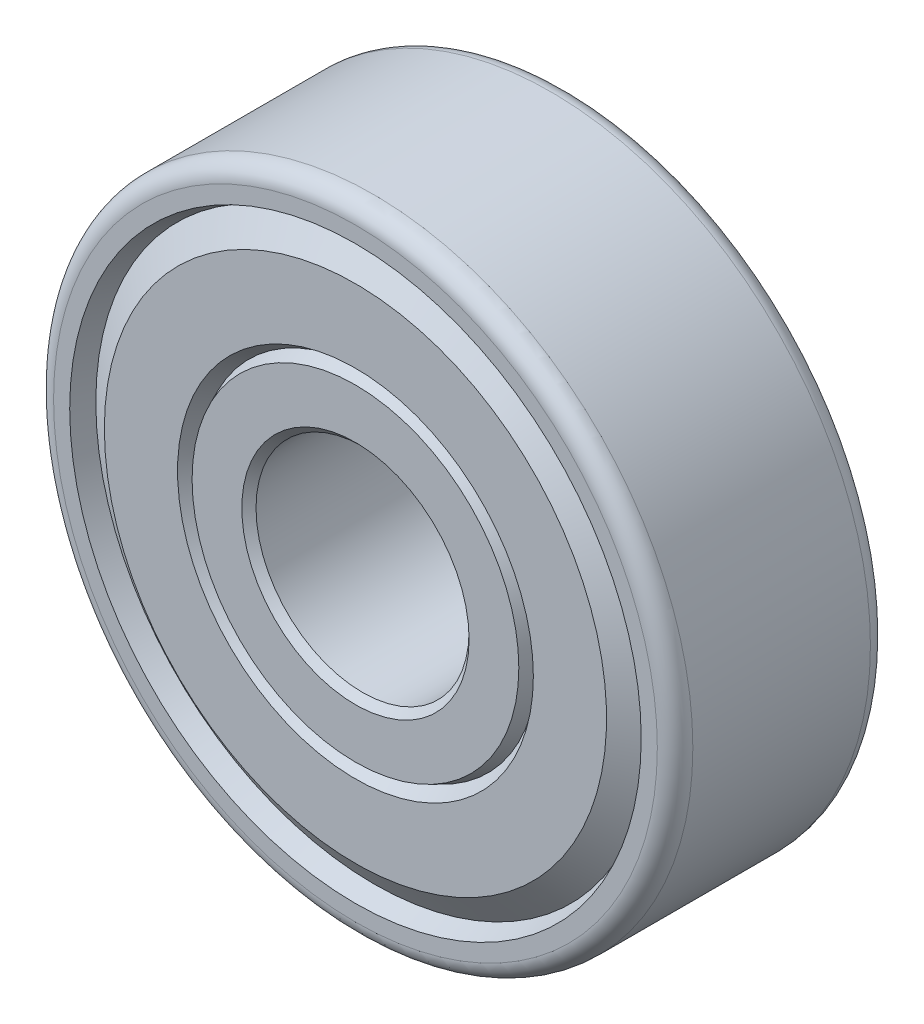
ISO-10303-21;
HEADER;
FILE_DESCRIPTION(('STEP AP214'),'2;1');
FILE_NAME('part.step','',(''),(''),'','','');
FILE_SCHEMA(('AUTOMOTIVE_DESIGN { 1 0 10303 214 1 1 1 1 }'));
ENDSEC;
DATA;
#1=APPLICATION_CONTEXT('core data for automotive mechanical design processes');
#2=APPLICATION_PROTOCOL_DEFINITION('international standard','automotive_design',2000,#1);
#3=PRODUCT_CONTEXT('',#1,'mechanical');
#4=PRODUCT('Part','Part','',(#3));
#5=PRODUCT_RELATED_PRODUCT_CATEGORY('part','',(#4));
#6=PRODUCT_DEFINITION_FORMATION('','',#4);
#7=PRODUCT_DEFINITION_CONTEXT('part definition',#1,'design');
#8=PRODUCT_DEFINITION('design','',#6,#7);
#9=PRODUCT_DEFINITION_SHAPE('','',#8);
#10=(LENGTH_UNIT() NAMED_UNIT(*) SI_UNIT(.MILLI.,.METRE.));
#11=(NAMED_UNIT(*) PLANE_ANGLE_UNIT() SI_UNIT($,.RADIAN.));
#12=(NAMED_UNIT(*) SI_UNIT($,.STERADIAN.) SOLID_ANGLE_UNIT());
#13=UNCERTAINTY_MEASURE_WITH_UNIT(LENGTH_MEASURE(1.E-05),#10,'distance_accuracy_value','');
#14=(GEOMETRIC_REPRESENTATION_CONTEXT(3) GLOBAL_UNCERTAINTY_ASSIGNED_CONTEXT((#13)) GLOBAL_UNIT_ASSIGNED_CONTEXT((#10,
#11,#12)) REPRESENTATION_CONTEXT('',''));
#15=CARTESIAN_POINT('',(0.,0.,0.));
#16=DIRECTION('',(0.,0.,1.));
#17=DIRECTION('',(1.,0.,0.));
#18=AXIS2_PLACEMENT_3D('',#15,#16,#17);
#19=CARTESIAN_POINT('',(0.,0.,0.));
#20=DIRECTION('',(0.,0.,1.));
#21=DIRECTION('',(1.,0.,0.));
#22=AXIS2_PLACEMENT_3D('',#19,#20,#21);
#23=CYLINDRICAL_SURFACE('',#22,4.7625);
#24=CARTESIAN_POINT('',(0.,0.,-4.44499999986192));
#25=DIRECTION('',(0.,0.,-1.));
#26=DIRECTION('',(-1.,0.,0.));
#27=AXIS2_PLACEMENT_3D('',#24,#25,#26);
#28=CIRCLE('',#27,4.76250000008349);
#29=CARTESIAN_POINT('',(-4.76250000008349,0.,-4.44499999986192));
#30=VERTEX_POINT('',#29);
#31=EDGE_CURVE('E320',#30,#30,#28,.T.);
#32=ORIENTED_EDGE('',*,*,#31,.T.);
#33=EDGE_LOOP('',(#32));
#34=FACE_BOUND('',#33,.T.);
#35=CARTESIAN_POINT('',(0.,0.,4.44499999986192));
#36=DIRECTION('',(0.,0.,1.));
#37=DIRECTION('',(-1.,0.,0.));
#38=AXIS2_PLACEMENT_3D('',#35,#36,#37);
#39=CIRCLE('',#38,4.76250000008349);
#40=CARTESIAN_POINT('',(-4.76250000008349,0.,4.44499999986192));
#41=VERTEX_POINT('',#40);
#42=EDGE_CURVE('E323',#41,#41,#39,.T.);
#43=ORIENTED_EDGE('',*,*,#42,.T.);
#44=EDGE_LOOP('',(#43));
#45=FACE_BOUND('',#44,.T.);
#46=ADVANCED_FACE('F17',(#34,#45),#23,.F.);
#47=CARTESIAN_POINT('',(0.,0.,-4.7624999999698));
#48=DIRECTION('',(0.,0.,-1.));
#49=DIRECTION('',(-1.,0.,0.));
#50=AXIS2_PLACEMENT_3D('',#47,#48,#49);
#51=CONICAL_SURFACE('',#50,5.07999999962294,0.785398162502276);
#52=CARTESIAN_POINT('',(0.,0.,-4.76250000008349));
#53=DIRECTION('',(0.,0.,-1.));
#54=DIRECTION('',(-1.,0.,0.));
#55=AXIS2_PLACEMENT_3D('',#52,#53,#54);
#56=CIRCLE('',#55,5.07999999973663);
#57=CARTESIAN_POINT('',(-5.07999999973663,0.,-4.76250000008349));
#58=VERTEX_POINT('',#57);
#59=EDGE_CURVE('E324',#58,#58,#56,.F.);
#60=ORIENTED_EDGE('',*,*,#59,.F.);
#61=EDGE_LOOP('',(#60));
#62=FACE_BOUND('',#61,.T.);
#63=ORIENTED_EDGE('',*,*,#31,.F.);
#64=EDGE_LOOP('',(#63));
#65=FACE_BOUND('',#64,.T.);
#66=ADVANCED_FACE('F249',(#62,#65),#51,.F.);
#67=CARTESIAN_POINT('',(0.,0.,4.7624999999698));
#68=DIRECTION('',(0.,0.,1.));
#69=DIRECTION('',(1.,0.,0.));
#70=AXIS2_PLACEMENT_3D('',#67,#68,#69);
#71=CONICAL_SURFACE('',#70,5.07999999962294,0.785398162502276);
#72=ORIENTED_EDGE('',*,*,#42,.F.);
#73=EDGE_LOOP('',(#72));
#74=FACE_BOUND('',#73,.T.);
#75=CARTESIAN_POINT('',(0.,0.,4.76250000008349));
#76=DIRECTION('',(0.,0.,1.));
#77=DIRECTION('',(1.,0.,0.));
#78=AXIS2_PLACEMENT_3D('',#75,#76,#77);
#79=CIRCLE('',#78,5.07999999973663);
#80=CARTESIAN_POINT('',(5.07999999973663,0.,4.76250000008349));
#81=VERTEX_POINT('',#80);
#82=EDGE_CURVE('E327',#81,#81,#79,.T.);
#83=ORIENTED_EDGE('',*,*,#82,.T.);
#84=EDGE_LOOP('',(#83));
#85=FACE_BOUND('',#84,.T.);
#86=ADVANCED_FACE('F241',(#74,#85),#71,.F.);
#87=CARTESIAN_POINT('',(0.,0.,-4.7625));
#88=DIRECTION('',(0.,0.,-1.));
#89=DIRECTION('',(-1.,0.,0.));
#90=AXIS2_PLACEMENT_3D('',#87,#88,#89);
#91=PLANE('',#90);
#92=ORIENTED_EDGE('',*,*,#59,.T.);
#93=EDGE_LOOP('',(#92));
#94=FACE_BOUND('',#93,.T.);
#95=CARTESIAN_POINT('',(0.,0.,-4.7625));
#96=DIRECTION('',(0.,0.,1.));
#97=DIRECTION('',(1.,0.,0.));
#98=AXIS2_PLACEMENT_3D('',#95,#96,#97);
#99=CIRCLE('',#98,7.3025);
#100=CARTESIAN_POINT('',(7.3025,0.,-4.7625));
#101=VERTEX_POINT('',#100);
#102=EDGE_CURVE('E357',#101,#101,#99,.T.);
#103=ORIENTED_EDGE('',*,*,#102,.F.);
#104=EDGE_LOOP('',(#103));
#105=FACE_BOUND('',#104,.T.);
#106=ADVANCED_FACE('F233',(#94,#105),#91,.T.);
#107=CARTESIAN_POINT('',(0.,0.,4.7625));
#108=DIRECTION('',(0.,0.,-1.));
#109=DIRECTION('',(-1.,0.,0.));
#110=AXIS2_PLACEMENT_3D('',#107,#108,#109);
#111=PLANE('',#110);
#112=ORIENTED_EDGE('',*,*,#82,.F.);
#113=EDGE_LOOP('',(#112));
#114=FACE_BOUND('',#113,.T.);
#115=CARTESIAN_POINT('',(0.,0.,4.76250000005854));
#116=DIRECTION('',(0.,0.,-1.));
#117=DIRECTION('',(-1.,0.,0.));
#118=AXIS2_PLACEMENT_3D('',#115,#116,#117);
#119=CIRCLE('',#118,7.30250000013546);
#120=CARTESIAN_POINT('',(-7.30250000013546,0.,4.76250000005854));
#121=VERTEX_POINT('',#120);
#122=EDGE_CURVE('E354',#121,#121,#119,.T.);
#123=ORIENTED_EDGE('',*,*,#122,.F.);
#124=EDGE_LOOP('',(#123));
#125=FACE_BOUND('',#124,.T.);
#126=ADVANCED_FACE('F225',(#114,#125),#111,.F.);
#127=CARTESIAN_POINT('',(0.,0.,-4.18132890087755));
#128=DIRECTION('',(0.,0.,1.));
#129=DIRECTION('',(1.,0.,0.));
#130=AXIS2_PLACEMENT_3D('',#127,#128,#129);
#131=CONICAL_SURFACE('',#130,7.55365742462336,0.407917424824535);
#132=CARTESIAN_POINT('',(0.,0.,-4.18132890087755));
#133=DIRECTION('',(0.,0.,-1.));
#134=DIRECTION('',(-1.,0.,0.));
#135=AXIS2_PLACEMENT_3D('',#132,#133,#134);
#136=CIRCLE('',#135,7.55365742462337);
#137=CARTESIAN_POINT('',(-7.55365742462337,0.,-4.18132890087755));
#138=VERTEX_POINT('',#137);
#139=EDGE_CURVE('E331',#138,#138,#136,.T.);
#140=ORIENTED_EDGE('',*,*,#139,.T.);
#141=EDGE_LOOP('',(#140));
#142=FACE_BOUND('',#141,.T.);
#143=ORIENTED_EDGE('',*,*,#102,.T.);
#144=EDGE_LOOP('',(#143));
#145=FACE_BOUND('',#144,.T.);
#146=ADVANCED_FACE('F217',(#142,#145),#131,.T.);
#147=CARTESIAN_POINT('',(0.,0.,4.18132890087755));
#148=DIRECTION('',(0.,0.,-1.));
#149=DIRECTION('',(-1.,0.,0.));
#150=AXIS2_PLACEMENT_3D('',#147,#148,#149);
#151=CONICAL_SURFACE('',#150,7.55365742446263,0.407917424358415);
#152=CARTESIAN_POINT('',(0.,0.,4.18132890066575));
#153=DIRECTION('',(0.,0.,1.));
#154=DIRECTION('',(-1.,0.,0.));
#155=AXIS2_PLACEMENT_3D('',#152,#153,#154);
#156=CIRCLE('',#155,7.55365742477154);
#157=CARTESIAN_POINT('',(-7.55365742477154,0.,4.18132890066575));
#158=VERTEX_POINT('',#157);
#159=EDGE_CURVE('E353',#158,#158,#156,.T.);
#160=ORIENTED_EDGE('',*,*,#159,.T.);
#161=EDGE_LOOP('',(#160));
#162=FACE_BOUND('',#161,.T.);
#163=ORIENTED_EDGE('',*,*,#122,.T.);
#164=EDGE_LOOP('',(#163));
#165=FACE_BOUND('',#164,.T.);
#166=ADVANCED_FACE('F209',(#162,#165),#151,.T.);
#167=CARTESIAN_POINT('',(0.,0.,-4.7625));
#168=DIRECTION('',(0.,0.,-1.));
#169=DIRECTION('',(-1.,0.,0.));
#170=AXIS2_PLACEMENT_3D('',#167,#168,#169);
#171=CONICAL_SURFACE('',#170,7.952136972928,0.601029540804804);
#172=ORIENTED_EDGE('',*,*,#139,.F.);
#173=EDGE_LOOP('',(#172));
#174=FACE_BOUND('',#173,.T.);
#175=CARTESIAN_POINT('',(0.,0.,-4.7625));
#176=DIRECTION('',(0.,0.,-1.));
#177=DIRECTION('',(-1.,0.,0.));
#178=AXIS2_PLACEMENT_3D('',#175,#176,#177);
#179=CIRCLE('',#178,7.952136972928);
#180=CARTESIAN_POINT('',(-7.952136972928,0.,-4.7625));
#181=VERTEX_POINT('',#180);
#182=EDGE_CURVE('E350',#181,#181,#179,.F.);
#183=ORIENTED_EDGE('',*,*,#182,.F.);
#184=EDGE_LOOP('',(#183));
#185=FACE_BOUND('',#184,.T.);
#186=ADVANCED_FACE('F201',(#174,#185),#171,.F.);
#187=CARTESIAN_POINT('',(0.,0.,4.7625));
#188=DIRECTION('',(0.,0.,1.));
#189=DIRECTION('',(1.,0.,0.));
#190=AXIS2_PLACEMENT_3D('',#187,#188,#189);
#191=CONICAL_SURFACE('',#190,7.95213697263462,0.601029540118035);
#192=CARTESIAN_POINT('',(0.,0.,4.7625));
#193=DIRECTION('',(0.,0.,1.));
#194=DIRECTION('',(1.,0.,0.));
#195=AXIS2_PLACEMENT_3D('',#192,#193,#194);
#196=CIRCLE('',#195,7.95213697263462);
#197=CARTESIAN_POINT('',(7.95213697263462,0.,4.7625));
#198=VERTEX_POINT('',#197);
#199=EDGE_CURVE('E347',#198,#198,#196,.T.);
#200=ORIENTED_EDGE('',*,*,#199,.T.);
#201=EDGE_LOOP('',(#200));
#202=FACE_BOUND('',#201,.T.);
#203=ORIENTED_EDGE('',*,*,#159,.F.);
#204=EDGE_LOOP('',(#203));
#205=FACE_BOUND('',#204,.T.);
#206=ADVANCED_FACE('F193',(#202,#205),#191,.F.);
#207=CARTESIAN_POINT('',(0.,0.,-4.7625));
#208=DIRECTION('',(0.,0.,-1.));
#209=DIRECTION('',(-1.,0.,0.));
#210=AXIS2_PLACEMENT_3D('',#207,#208,#209);
#211=PLANE('',#210);
#212=ORIENTED_EDGE('',*,*,#182,.T.);
#213=EDGE_LOOP('',(#212));
#214=FACE_BOUND('',#213,.T.);
#215=CARTESIAN_POINT('',(0.,0.,-4.7625));
#216=DIRECTION('',(0.,0.,1.));
#217=DIRECTION('',(1.,0.,0.));
#218=AXIS2_PLACEMENT_3D('',#215,#216,#217);
#219=CIRCLE('',#218,11.2241326943492);
#220=CARTESIAN_POINT('',(11.2241326943492,0.,-4.7625));
#221=VERTEX_POINT('',#220);
#222=EDGE_CURVE('E344',#221,#221,#219,.T.);
#223=ORIENTED_EDGE('',*,*,#222,.F.);
#224=EDGE_LOOP('',(#223));
#225=FACE_BOUND('',#224,.T.);
#226=ADVANCED_FACE('F185',(#214,#225),#211,.T.);
#227=CARTESIAN_POINT('',(0.,0.,4.7625));
#228=DIRECTION('',(0.,0.,-1.));
#229=DIRECTION('',(-1.,0.,0.));
#230=AXIS2_PLACEMENT_3D('',#227,#228,#229);
#231=PLANE('',#230);
#232=ORIENTED_EDGE('',*,*,#199,.F.);
#233=EDGE_LOOP('',(#232));
#234=FACE_BOUND('',#233,.T.);
#235=CARTESIAN_POINT('',(0.,0.,4.76250000067259));
#236=DIRECTION('',(0.,0.,-1.));
#237=DIRECTION('',(-1.,0.,0.));
#238=AXIS2_PLACEMENT_3D('',#235,#236,#237);
#239=CIRCLE('',#238,11.2241326948103);
#240=CARTESIAN_POINT('',(-11.2241326948103,0.,4.76250000067259));
#241=VERTEX_POINT('',#240);
#242=EDGE_CURVE('E340',#241,#241,#239,.T.);
#243=ORIENTED_EDGE('',*,*,#242,.F.);
#244=EDGE_LOOP('',(#243));
#245=FACE_BOUND('',#244,.T.);
#246=ADVANCED_FACE('F177',(#234,#245),#231,.F.);
#247=CARTESIAN_POINT('',(0.,0.,-3.93017144225871));
#248=DIRECTION('',(0.,0.,1.));
#249=DIRECTION('',(1.,0.,0.));
#250=AXIS2_PLACEMENT_3D('',#247,#248,#249);
#251=CONICAL_SURFACE('',#250,12.4380602466955,0.969766785990084);
#252=CARTESIAN_POINT('',(0.,0.,-3.93017144225872));
#253=DIRECTION('',(0.,0.,-1.));
#254=DIRECTION('',(-1.,0.,0.));
#255=AXIS2_PLACEMENT_3D('',#252,#253,#254);
#256=CIRCLE('',#255,12.4380602466955);
#257=CARTESIAN_POINT('',(-12.4380602466955,0.,-3.93017144225872));
#258=VERTEX_POINT('',#257);
#259=EDGE_CURVE('E343',#258,#258,#256,.T.);
#260=ORIENTED_EDGE('',*,*,#259,.T.);
#261=EDGE_LOOP('',(#260));
#262=FACE_BOUND('',#261,.T.);
#263=ORIENTED_EDGE('',*,*,#222,.T.);
#264=EDGE_LOOP('',(#263));
#265=FACE_BOUND('',#264,.T.);
#266=ADVANCED_FACE('F169',(#262,#265),#251,.T.);
#267=CARTESIAN_POINT('',(0.,0.,3.93017144225871));
#268=DIRECTION('',(0.,0.,-1.));
#269=DIRECTION('',(-1.,0.,0.));
#270=AXIS2_PLACEMENT_3D('',#267,#268,#269);
#271=CONICAL_SURFACE('',#270,12.4380602452534,0.969766784881962);
#272=CARTESIAN_POINT('',(0.,0.,3.93017144168615));
#273=DIRECTION('',(0.,0.,1.));
#274=DIRECTION('',(-1.,0.,0.));
#275=AXIS2_PLACEMENT_3D('',#272,#273,#274);
#276=CIRCLE('',#275,12.4380602466765);
#277=CARTESIAN_POINT('',(-12.4380602466765,0.,3.93017144168615));
#278=VERTEX_POINT('',#277);
#279=EDGE_CURVE('E339',#278,#278,#276,.T.);
#280=ORIENTED_EDGE('',*,*,#279,.T.);
#281=EDGE_LOOP('',(#280));
#282=FACE_BOUND('',#281,.T.);
#283=ORIENTED_EDGE('',*,*,#242,.T.);
#284=EDGE_LOOP('',(#283));
#285=FACE_BOUND('',#284,.T.);
#286=ADVANCED_FACE('F161',(#282,#285),#271,.T.);
#287=CARTESIAN_POINT('',(0.,0.,-4.7625));
#288=DIRECTION('',(0.,0.,-1.));
#289=DIRECTION('',(-1.,0.,0.));
#290=AXIS2_PLACEMENT_3D('',#287,#288,#289);
#291=CONICAL_SURFACE('',#290,12.7729368128599,0.382519398268516);
#292=ORIENTED_EDGE('',*,*,#259,.F.);
#293=EDGE_LOOP('',(#292));
#294=FACE_BOUND('',#293,.T.);
#295=CARTESIAN_POINT('',(0.,0.,-4.7625));
#296=DIRECTION('',(0.,0.,-1.));
#297=DIRECTION('',(-1.,0.,0.));
#298=AXIS2_PLACEMENT_3D('',#295,#296,#297);
#299=CIRCLE('',#298,12.7729368128599);
#300=CARTESIAN_POINT('',(-12.7729368128599,0.,-4.7625));
#301=VERTEX_POINT('',#300);
#302=EDGE_CURVE('E336',#301,#301,#299,.F.);
#303=ORIENTED_EDGE('',*,*,#302,.F.);
#304=EDGE_LOOP('',(#303));
#305=FACE_BOUND('',#304,.T.);
#306=ADVANCED_FACE('F153',(#294,#305),#291,.F.);
#307=CARTESIAN_POINT('',(0.,0.,4.7625));
#308=DIRECTION('',(0.,0.,1.));
#309=DIRECTION('',(1.,0.,0.));
#310=AXIS2_PLACEMENT_3D('',#307,#308,#309);
#311=CONICAL_SURFACE('',#310,12.7729368126486,0.382519397831445);
#312=CARTESIAN_POINT('',(0.,0.,4.7625));
#313=DIRECTION('',(0.,0.,1.));
#314=DIRECTION('',(1.,0.,0.));
#315=AXIS2_PLACEMENT_3D('',#312,#313,#314);
#316=CIRCLE('',#315,12.7729368126486);
#317=CARTESIAN_POINT('',(12.7729368126486,0.,4.7625));
#318=VERTEX_POINT('',#317);
#319=EDGE_CURVE('E52',#318,#318,#316,.T.);
#320=ORIENTED_EDGE('',*,*,#319,.T.);
#321=EDGE_LOOP('',(#320));
#322=FACE_BOUND('',#321,.T.);
#323=ORIENTED_EDGE('',*,*,#279,.F.);
#324=EDGE_LOOP('',(#323));
#325=FACE_BOUND('',#324,.T.);
#326=ADVANCED_FACE('F146',(#322,#325),#311,.F.);
#327=CARTESIAN_POINT('',(0.,0.,-4.7625));
#328=DIRECTION('',(0.,0.,-1.));
#329=DIRECTION('',(-1.,0.,0.));
#330=AXIS2_PLACEMENT_3D('',#327,#328,#329);
#331=PLANE('',#330);
#332=ORIENTED_EDGE('',*,*,#302,.T.);
#333=EDGE_LOOP('',(#332));
#334=FACE_BOUND('',#333,.T.);
#335=CARTESIAN_POINT('',(0.,0.,-4.76249999999999));
#336=DIRECTION('',(0.,0.,1.));
#337=DIRECTION('',(1.,0.,0.));
#338=AXIS2_PLACEMENT_3D('',#335,#336,#337);
#339=CIRCLE('',#338,13.49375);
#340=CARTESIAN_POINT('',(13.49375,0.,-4.7625));
#341=VERTEX_POINT('',#340);
#342=CARTESIAN_POINT('',(-13.49375,0.,-4.7625));
#343=VERTEX_POINT('',#342);
#344=EDGE_CURVE('E45',#341,#343,#339,.T.);
#345=ORIENTED_EDGE('',*,*,#344,.F.);
#346=CARTESIAN_POINT('',(0.,0.,-4.76249999999999));
#347=DIRECTION('',(0.,0.,1.));
#348=DIRECTION('',(-1.,0.,0.));
#349=AXIS2_PLACEMENT_3D('',#346,#347,#348);
#350=CIRCLE('',#349,13.49375);
#351=EDGE_CURVE('E50',#343,#341,#350,.T.);
#352=ORIENTED_EDGE('',*,*,#351,.F.);
#353=EDGE_LOOP('',(#345,#352));
#354=FACE_BOUND('',#353,.T.);
#355=ADVANCED_FACE('F49',(#334,#354),#331,.T.);
#356=CARTESIAN_POINT('',(0.,0.,4.7625));
#357=DIRECTION('',(0.,0.,-1.));
#358=DIRECTION('',(-1.,0.,0.));
#359=AXIS2_PLACEMENT_3D('',#356,#357,#358);
#360=PLANE('',#359);
#361=ORIENTED_EDGE('',*,*,#319,.F.);
#362=EDGE_LOOP('',(#361));
#363=FACE_BOUND('',#362,.T.);
#364=CARTESIAN_POINT('',(0.,0.,4.76250000000002));
#365=DIRECTION('',(0.,0.,-1.));
#366=DIRECTION('',(1.,0.,0.));
#367=AXIS2_PLACEMENT_3D('',#364,#365,#366);
#368=CIRCLE('',#367,13.49375);
#369=CARTESIAN_POINT('',(13.49375,0.,4.76250000000001));
#370=VERTEX_POINT('',#369);
#371=CARTESIAN_POINT('',(-13.49375,0.,4.76250000000001));
#372=VERTEX_POINT('',#371);
#373=EDGE_CURVE('E57',#370,#372,#368,.T.);
#374=ORIENTED_EDGE('',*,*,#373,.F.);
#375=CARTESIAN_POINT('',(0.,0.,4.76250000000002));
#376=DIRECTION('',(0.,0.,-1.));
#377=DIRECTION('',(-1.,0.,0.));
#378=AXIS2_PLACEMENT_3D('',#375,#376,#377);
#379=CIRCLE('',#378,13.49375);
#380=EDGE_CURVE('E36',#372,#370,#379,.T.);
#381=ORIENTED_EDGE('',*,*,#380,.F.);
#382=EDGE_LOOP('',(#374,#381));
#383=FACE_BOUND('',#382,.T.);
#384=ADVANCED_FACE('F78',(#363,#383),#360,.F.);
#385=CARTESIAN_POINT('',(0.,0.,-3.96874999999999));
#386=DIRECTION('',(0.,0.,1.));
#387=DIRECTION('',(1.,0.,0.));
#388=AXIS2_PLACEMENT_3D('',#385,#386,#387);
#389=TOROIDAL_SURFACE('',#388,13.49375,0.79375);
#390=ORIENTED_EDGE('',*,*,#344,.T.);
#391=ORIENTED_EDGE('',*,*,#351,.T.);
#392=EDGE_LOOP('',(#390,#391));
#393=FACE_BOUND('',#392,.T.);
#394=CARTESIAN_POINT('',(0.,0.,-3.96874999999999));
#395=DIRECTION('',(0.,0.,1.));
#396=DIRECTION('',(1.,0.,0.));
#397=AXIS2_PLACEMENT_3D('',#394,#395,#396);
#398=CIRCLE('',#397,14.2875);
#399=CARTESIAN_POINT('',(14.2875,0.,-3.96874999999999));
#400=VERTEX_POINT('',#399);
#401=EDGE_CURVE('E28',#400,#400,#398,.T.);
#402=ORIENTED_EDGE('',*,*,#401,.F.);
#403=EDGE_LOOP('',(#402));
#404=FACE_BOUND('',#403,.T.);
#405=ADVANCED_FACE('F55',(#393,#404),#389,.T.);
#406=CARTESIAN_POINT('',(0.,0.,3.96875000000002));
#407=DIRECTION('',(0.,0.,-1.));
#408=DIRECTION('',(-1.,0.,0.));
#409=AXIS2_PLACEMENT_3D('',#406,#407,#408);
#410=TOROIDAL_SURFACE('',#409,13.49375,0.79375);
#411=ORIENTED_EDGE('',*,*,#380,.T.);
#412=ORIENTED_EDGE('',*,*,#373,.T.);
#413=EDGE_LOOP('',(#411,#412));
#414=FACE_BOUND('',#413,.T.);
#415=CARTESIAN_POINT('',(0.,0.,3.96875000000002));
#416=DIRECTION('',(0.,0.,1.));
#417=DIRECTION('',(1.,0.,0.));
#418=AXIS2_PLACEMENT_3D('',#415,#416,#417);
#419=CIRCLE('',#418,14.2875);
#420=CARTESIAN_POINT('',(14.2875,0.,3.96875000000002));
#421=VERTEX_POINT('',#420);
#422=EDGE_CURVE('E11',#421,#421,#419,.F.);
#423=ORIENTED_EDGE('',*,*,#422,.F.);
#424=EDGE_LOOP('',(#423));
#425=FACE_BOUND('',#424,.T.);
#426=ADVANCED_FACE('F77',(#414,#425),#410,.T.);
#427=CARTESIAN_POINT('',(0.,0.,0.));
#428=DIRECTION('',(0.,0.,1.));
#429=DIRECTION('',(1.,0.,0.));
#430=AXIS2_PLACEMENT_3D('',#427,#428,#429);
#431=CYLINDRICAL_SURFACE('',#430,14.2875);
#432=ORIENTED_EDGE('',*,*,#422,.T.);
#433=EDGE_LOOP('',(#432));
#434=FACE_BOUND('',#433,.T.);
#435=ORIENTED_EDGE('',*,*,#401,.T.);
#436=EDGE_LOOP('',(#435));
#437=FACE_BOUND('',#436,.T.);
#438=ADVANCED_FACE('F118',(#434,#437),#431,.T.);
#439=CLOSED_SHELL('',(#46,#66,#86,#106,#126,#146,#166,#186,#206,#226,#246,#266,#286,#306,#326,
#355,#384,#405,#426,#438));
#440=MANIFOLD_SOLID_BREP('B1',#439);
#441=ADVANCED_BREP_SHAPE_REPRESENTATION('',(#18,#440),#14);
#442=SHAPE_DEFINITION_REPRESENTATION(#9,#441);
ENDSEC;
END-ISO-10303-21;
